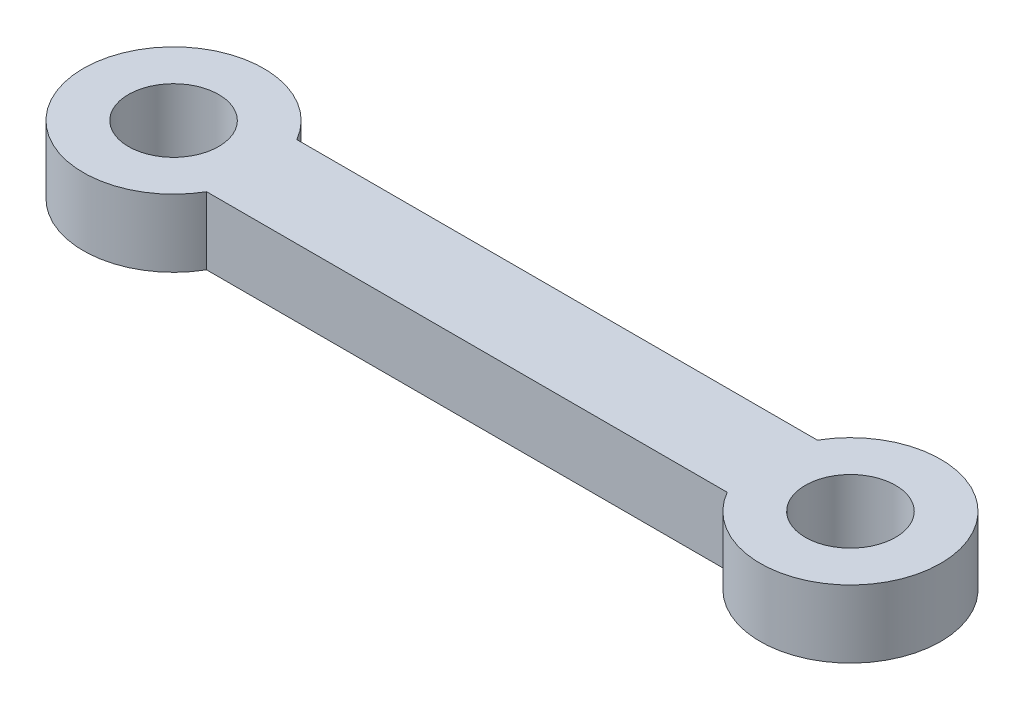
ISO-10303-21;
HEADER;
FILE_DESCRIPTION(('STEP AP214'),'2;1');
FILE_NAME('part.step','',(''),(''),'','','');
FILE_SCHEMA(('AUTOMOTIVE_DESIGN { 1 0 10303 214 1 1 1 1 }'));
ENDSEC;
DATA;
#1=APPLICATION_CONTEXT('core data for automotive mechanical design processes');
#2=APPLICATION_PROTOCOL_DEFINITION('international standard','automotive_design',2000,#1);
#3=PRODUCT_CONTEXT('',#1,'mechanical');
#4=PRODUCT('Part','Part','',(#3));
#5=PRODUCT_RELATED_PRODUCT_CATEGORY('part','',(#4));
#6=PRODUCT_DEFINITION_FORMATION('','',#4);
#7=PRODUCT_DEFINITION_CONTEXT('part definition',#1,'design');
#8=PRODUCT_DEFINITION('design','',#6,#7);
#9=PRODUCT_DEFINITION_SHAPE('','',#8);
#10=(LENGTH_UNIT() NAMED_UNIT(*) SI_UNIT(.MILLI.,.METRE.));
#11=(NAMED_UNIT(*) PLANE_ANGLE_UNIT() SI_UNIT($,.RADIAN.));
#12=(NAMED_UNIT(*) SI_UNIT($,.STERADIAN.) SOLID_ANGLE_UNIT());
#13=UNCERTAINTY_MEASURE_WITH_UNIT(LENGTH_MEASURE(1.E-05),#10,'distance_accuracy_value','');
#14=(GEOMETRIC_REPRESENTATION_CONTEXT(3) GLOBAL_UNCERTAINTY_ASSIGNED_CONTEXT((#13)) GLOBAL_UNIT_ASSIGNED_CONTEXT((#10,
#11,#12)) REPRESENTATION_CONTEXT('',''));
#15=CARTESIAN_POINT('',(0.,0.,0.));
#16=DIRECTION('',(0.,0.,1.));
#17=DIRECTION('',(1.,0.,0.));
#18=AXIS2_PLACEMENT_3D('',#15,#16,#17);
#19=CARTESIAN_POINT('',(-22.5,9.75,0.));
#20=DIRECTION('',(0.,-1.,0.));
#21=DIRECTION('',(0.,0.,-1.));
#22=AXIS2_PLACEMENT_3D('',#19,#20,#21);
#23=CYLINDRICAL_SURFACE('',#22,6.);
#24=CARTESIAN_POINT('',(-22.5,5.25,0.));
#25=DIRECTION('',(0.,1.,0.));
#26=DIRECTION('',(0.,0.,1.));
#27=AXIS2_PLACEMENT_3D('',#24,#25,#26);
#28=CIRCLE('',#27,6.);
#29=CARTESIAN_POINT('',(-17.3038475772934,5.25,-3.));
#30=VERTEX_POINT('',#29);
#31=CARTESIAN_POINT('',(-17.3038475772934,5.25,3.));
#32=VERTEX_POINT('',#31);
#33=EDGE_CURVE('E97',#30,#32,#28,.T.);
#34=ORIENTED_EDGE('',*,*,#33,.T.);
#35=DIRECTION('',(0.,-1.,0.));
#36=VECTOR('',#35,1.);
#37=CARTESIAN_POINT('',(-17.3038475772934,9.75,3.));
#38=LINE('',#37,#36);
#39=CARTESIAN_POINT('',(-17.3038475772934,9.75,3.));
#40=VERTEX_POINT('',#39);
#41=EDGE_CURVE('E11',#40,#32,#38,.T.);
#42=ORIENTED_EDGE('',*,*,#41,.F.);
#43=CARTESIAN_POINT('',(-22.5,9.75,0.));
#44=DIRECTION('',(0.,1.,0.));
#45=DIRECTION('',(0.,0.,1.));
#46=AXIS2_PLACEMENT_3D('',#43,#44,#45);
#47=CIRCLE('',#46,6.);
#48=CARTESIAN_POINT('',(-17.3038475772934,9.75,-3.));
#49=VERTEX_POINT('',#48);
#50=EDGE_CURVE('E85',#49,#40,#47,.T.);
#51=ORIENTED_EDGE('',*,*,#50,.F.);
#52=DIRECTION('',(0.,-1.,0.));
#53=VECTOR('',#52,1.);
#54=CARTESIAN_POINT('',(-17.3038475772934,9.75,-3.));
#55=LINE('',#54,#53);
#56=EDGE_CURVE('E93',#49,#30,#55,.T.);
#57=ORIENTED_EDGE('',*,*,#56,.T.);
#58=EDGE_LOOP('',(#34,#42,#51,#57));
#59=FACE_BOUND('',#58,.T.);
#60=ADVANCED_FACE('F34',(#59),#23,.T.);
#61=CARTESIAN_POINT('',(17.3038475772934,9.75,3.));
#62=DIRECTION('',(0.,0.,-1.));
#63=DIRECTION('',(-1.,0.,0.));
#64=AXIS2_PLACEMENT_3D('',#61,#62,#63);
#65=PLANE('',#64);
#66=DIRECTION('',(1.,0.,0.));
#67=VECTOR('',#66,1.);
#68=CARTESIAN_POINT('',(17.3038475772934,5.25,3.));
#69=LINE('',#68,#67);
#70=CARTESIAN_POINT('',(17.3038475772934,5.25,3.));
#71=VERTEX_POINT('',#70);
#72=EDGE_CURVE('E89',#32,#71,#69,.T.);
#73=ORIENTED_EDGE('',*,*,#72,.T.);
#74=DIRECTION('',(0.,-1.,0.));
#75=VECTOR('',#74,1.);
#76=CARTESIAN_POINT('',(17.3038475772934,9.75,3.));
#77=LINE('',#76,#75);
#78=CARTESIAN_POINT('',(17.3038475772934,9.75,3.));
#79=VERTEX_POINT('',#78);
#80=EDGE_CURVE('E42',#79,#71,#77,.T.);
#81=ORIENTED_EDGE('',*,*,#80,.F.);
#82=DIRECTION('',(1.,0.,0.));
#83=VECTOR('',#82,1.);
#84=CARTESIAN_POINT('',(17.3038475772934,9.75,3.));
#85=LINE('',#84,#83);
#86=EDGE_CURVE('E80',#40,#79,#85,.T.);
#87=ORIENTED_EDGE('',*,*,#86,.F.);
#88=ORIENTED_EDGE('',*,*,#41,.T.);
#89=EDGE_LOOP('',(#73,#81,#87,#88));
#90=FACE_BOUND('',#89,.T.);
#91=ADVANCED_FACE('F88',(#90),#65,.F.);
#92=CARTESIAN_POINT('',(22.5,9.75,0.));
#93=DIRECTION('',(0.,-1.,0.));
#94=DIRECTION('',(0.,0.,-1.));
#95=AXIS2_PLACEMENT_3D('',#92,#93,#94);
#96=CYLINDRICAL_SURFACE('',#95,6.);
#97=CARTESIAN_POINT('',(22.5,5.25,0.));
#98=DIRECTION('',(0.,1.,0.));
#99=DIRECTION('',(0.,0.,-1.));
#100=AXIS2_PLACEMENT_3D('',#97,#98,#99);
#101=CIRCLE('',#100,6.);
#102=CARTESIAN_POINT('',(17.3038475772934,5.25,-3.));
#103=VERTEX_POINT('',#102);
#104=EDGE_CURVE('E67',#71,#103,#101,.T.);
#105=ORIENTED_EDGE('',*,*,#104,.T.);
#106=DIRECTION('',(0.,-1.,0.));
#107=VECTOR('',#106,1.);
#108=CARTESIAN_POINT('',(17.3038475772934,9.75,-3.));
#109=LINE('',#108,#107);
#110=CARTESIAN_POINT('',(17.3038475772934,9.75,-3.));
#111=VERTEX_POINT('',#110);
#112=EDGE_CURVE('E90',#111,#103,#109,.T.);
#113=ORIENTED_EDGE('',*,*,#112,.F.);
#114=CARTESIAN_POINT('',(22.5,9.75,0.));
#115=DIRECTION('',(0.,1.,0.));
#116=DIRECTION('',(0.,0.,-1.));
#117=AXIS2_PLACEMENT_3D('',#114,#115,#116);
#118=CIRCLE('',#117,6.);
#119=EDGE_CURVE('E83',#79,#111,#118,.T.);
#120=ORIENTED_EDGE('',*,*,#119,.F.);
#121=ORIENTED_EDGE('',*,*,#80,.T.);
#122=EDGE_LOOP('',(#105,#113,#120,#121));
#123=FACE_BOUND('',#122,.T.);
#124=ADVANCED_FACE('F91',(#123),#96,.T.);
#125=CARTESIAN_POINT('',(17.3038475772934,9.75,-3.));
#126=DIRECTION('',(0.,0.,1.));
#127=DIRECTION('',(1.,0.,0.));
#128=AXIS2_PLACEMENT_3D('',#125,#126,#127);
#129=PLANE('',#128);
#130=DIRECTION('',(-1.,0.,0.));
#131=VECTOR('',#130,1.);
#132=CARTESIAN_POINT('',(17.3038475772934,5.25,-3.));
#133=LINE('',#132,#131);
#134=EDGE_CURVE('E73',#103,#30,#133,.T.);
#135=ORIENTED_EDGE('',*,*,#134,.T.);
#136=ORIENTED_EDGE('',*,*,#56,.F.);
#137=DIRECTION('',(-1.,0.,0.));
#138=VECTOR('',#137,1.);
#139=CARTESIAN_POINT('',(17.3038475772934,9.75,-3.));
#140=LINE('',#139,#138);
#141=EDGE_CURVE('E50',#111,#49,#140,.T.);
#142=ORIENTED_EDGE('',*,*,#141,.F.);
#143=ORIENTED_EDGE('',*,*,#112,.T.);
#144=EDGE_LOOP('',(#135,#136,#142,#143));
#145=FACE_BOUND('',#144,.T.);
#146=ADVANCED_FACE('F105',(#145),#129,.F.);
#147=CARTESIAN_POINT('',(-22.5,9.75,0.));
#148=DIRECTION('',(0.,1.,0.));
#149=DIRECTION('',(0.,0.,1.));
#150=AXIS2_PLACEMENT_3D('',#147,#148,#149);
#151=PLANE('',#150);
#152=CARTESIAN_POINT('',(-22.5,9.75,0.));
#153=DIRECTION('',(0.,1.,0.));
#154=DIRECTION('',(0.,0.,1.));
#155=AXIS2_PLACEMENT_3D('',#152,#153,#154);
#156=CIRCLE('',#155,3.);
#157=CARTESIAN_POINT('',(-22.5,9.75,3.));
#158=VERTEX_POINT('',#157);
#159=EDGE_CURVE('E119',#158,#158,#156,.T.);
#160=ORIENTED_EDGE('',*,*,#159,.F.);
#161=EDGE_LOOP('',(#160));
#162=FACE_BOUND('',#161,.T.);
#163=CARTESIAN_POINT('',(22.5,9.75,0.));
#164=DIRECTION('',(0.,1.,0.));
#165=DIRECTION('',(0.,0.,1.));
#166=AXIS2_PLACEMENT_3D('',#163,#164,#165);
#167=CIRCLE('',#166,3.);
#168=CARTESIAN_POINT('',(22.5,9.75,3.));
#169=VERTEX_POINT('',#168);
#170=EDGE_CURVE('E113',#169,#169,#167,.T.);
#171=ORIENTED_EDGE('',*,*,#170,.F.);
#172=EDGE_LOOP('',(#171));
#173=FACE_BOUND('',#172,.T.);
#174=ORIENTED_EDGE('',*,*,#50,.T.);
#175=ORIENTED_EDGE('',*,*,#86,.T.);
#176=ORIENTED_EDGE('',*,*,#119,.T.);
#177=ORIENTED_EDGE('',*,*,#141,.T.);
#178=EDGE_LOOP('',(#174,#175,#176,#177));
#179=FACE_BOUND('',#178,.T.);
#180=ADVANCED_FACE('F81',(#162,#173,#179),#151,.T.);
#181=CARTESIAN_POINT('',(-22.5,5.25,0.));
#182=DIRECTION('',(0.,1.,0.));
#183=DIRECTION('',(0.,0.,1.));
#184=AXIS2_PLACEMENT_3D('',#181,#182,#183);
#185=PLANE('',#184);
#186=CARTESIAN_POINT('',(-22.5,5.25,0.));
#187=DIRECTION('',(0.,1.,0.));
#188=DIRECTION('',(0.,0.,1.));
#189=AXIS2_PLACEMENT_3D('',#186,#187,#188);
#190=CIRCLE('',#189,3.);
#191=CARTESIAN_POINT('',(-22.5,5.25,3.));
#192=VERTEX_POINT('',#191);
#193=EDGE_CURVE('E116',#192,#192,#190,.T.);
#194=ORIENTED_EDGE('',*,*,#193,.T.);
#195=EDGE_LOOP('',(#194));
#196=FACE_BOUND('',#195,.T.);
#197=CARTESIAN_POINT('',(22.5,5.25,0.));
#198=DIRECTION('',(0.,1.,0.));
#199=DIRECTION('',(0.,0.,1.));
#200=AXIS2_PLACEMENT_3D('',#197,#198,#199);
#201=CIRCLE('',#200,3.);
#202=CARTESIAN_POINT('',(22.5,5.25,3.));
#203=VERTEX_POINT('',#202);
#204=EDGE_CURVE('E100',#203,#203,#201,.T.);
#205=ORIENTED_EDGE('',*,*,#204,.T.);
#206=EDGE_LOOP('',(#205));
#207=FACE_BOUND('',#206,.T.);
#208=ORIENTED_EDGE('',*,*,#33,.F.);
#209=ORIENTED_EDGE('',*,*,#134,.F.);
#210=ORIENTED_EDGE('',*,*,#104,.F.);
#211=ORIENTED_EDGE('',*,*,#72,.F.);
#212=EDGE_LOOP('',(#208,#209,#210,#211));
#213=FACE_BOUND('',#212,.T.);
#214=ADVANCED_FACE('F108',(#196,#207,#213),#185,.F.);
#215=CARTESIAN_POINT('',(22.5,9.75,0.));
#216=DIRECTION('',(0.,1.,0.));
#217=DIRECTION('',(0.,0.,1.));
#218=AXIS2_PLACEMENT_3D('',#215,#216,#217);
#219=CYLINDRICAL_SURFACE('',#218,3.);
#220=ORIENTED_EDGE('',*,*,#204,.F.);
#221=EDGE_LOOP('',(#220));
#222=FACE_BOUND('',#221,.T.);
#223=ORIENTED_EDGE('',*,*,#170,.T.);
#224=EDGE_LOOP('',(#223));
#225=FACE_BOUND('',#224,.T.);
#226=ADVANCED_FACE('F130',(#222,#225),#219,.F.);
#227=CARTESIAN_POINT('',(-22.5,9.75,0.));
#228=DIRECTION('',(0.,1.,0.));
#229=DIRECTION('',(0.,0.,1.));
#230=AXIS2_PLACEMENT_3D('',#227,#228,#229);
#231=CYLINDRICAL_SURFACE('',#230,3.);
#232=ORIENTED_EDGE('',*,*,#193,.F.);
#233=EDGE_LOOP('',(#232));
#234=FACE_BOUND('',#233,.T.);
#235=ORIENTED_EDGE('',*,*,#159,.T.);
#236=EDGE_LOOP('',(#235));
#237=FACE_BOUND('',#236,.T.);
#238=ADVANCED_FACE('F123',(#234,#237),#231,.F.);
#239=CLOSED_SHELL('',(#60,#91,#124,#146,#180,#214,#226,#238));
#240=MANIFOLD_SOLID_BREP('B2',#239);
#241=ADVANCED_BREP_SHAPE_REPRESENTATION('',(#18,#240),#14);
#242=SHAPE_DEFINITION_REPRESENTATION(#9,#241);
ENDSEC;
END-ISO-10303-21;
